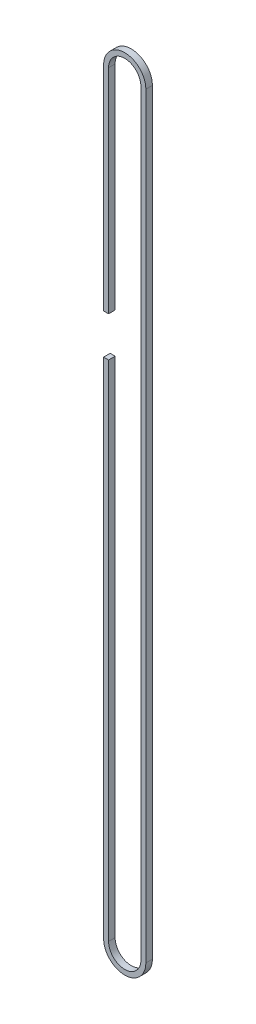
ISO-10303-21;
HEADER;
FILE_DESCRIPTION(('STEP AP214'),'2;1');
FILE_NAME('part.step','',(''),(''),'','','');
FILE_SCHEMA(('AUTOMOTIVE_DESIGN { 1 0 10303 214 1 1 1 1 }'));
ENDSEC;
DATA;
#1=APPLICATION_CONTEXT('core data for automotive mechanical design processes');
#2=APPLICATION_PROTOCOL_DEFINITION('international standard','automotive_design',2000,#1);
#3=PRODUCT_CONTEXT('',#1,'mechanical');
#4=PRODUCT('Part','Part','',(#3));
#5=PRODUCT_RELATED_PRODUCT_CATEGORY('part','',(#4));
#6=PRODUCT_DEFINITION_FORMATION('','',#4);
#7=PRODUCT_DEFINITION_CONTEXT('part definition',#1,'design');
#8=PRODUCT_DEFINITION('design','',#6,#7);
#9=PRODUCT_DEFINITION_SHAPE('','',#8);
#10=(LENGTH_UNIT() NAMED_UNIT(*) SI_UNIT(.MILLI.,.METRE.));
#11=(NAMED_UNIT(*) PLANE_ANGLE_UNIT() SI_UNIT($,.RADIAN.));
#12=(NAMED_UNIT(*) SI_UNIT($,.STERADIAN.) SOLID_ANGLE_UNIT());
#13=UNCERTAINTY_MEASURE_WITH_UNIT(LENGTH_MEASURE(1.E-05),#10,'distance_accuracy_value','');
#14=(GEOMETRIC_REPRESENTATION_CONTEXT(3) GLOBAL_UNCERTAINTY_ASSIGNED_CONTEXT((#13)) GLOBAL_UNIT_ASSIGNED_CONTEXT((#10,
#11,#12)) REPRESENTATION_CONTEXT('',''));
#15=CARTESIAN_POINT('',(0.,0.,0.));
#16=DIRECTION('',(0.,0.,1.));
#17=DIRECTION('',(1.,0.,0.));
#18=AXIS2_PLACEMENT_3D('',#15,#16,#17);
#19=CARTESIAN_POINT('',(0.,901.7,3.8989));
#20=DIRECTION('',(0.,0.,-1.));
#21=DIRECTION('',(-1.,0.,0.));
#22=AXIS2_PLACEMENT_3D('',#19,#20,#21);
#23=CYLINDRICAL_SURFACE('',#22,25.1587);
#24=CARTESIAN_POINT('',(0.,901.7,-3.8989));
#25=DIRECTION('',(0.,0.,1.));
#26=DIRECTION('',(-1.,0.,0.));
#27=AXIS2_PLACEMENT_3D('',#24,#25,#26);
#28=CIRCLE('',#27,25.1587);
#29=CARTESIAN_POINT('',(25.1587,901.7,-3.8989));
#30=VERTEX_POINT('',#29);
#31=CARTESIAN_POINT('',(-25.1587,901.7,-3.8989));
#32=VERTEX_POINT('',#31);
#33=EDGE_CURVE('E159',#30,#32,#28,.T.);
#34=ORIENTED_EDGE('',*,*,#33,.T.);
#35=DIRECTION('',(0.,0.,-1.));
#36=VECTOR('',#35,1.);
#37=CARTESIAN_POINT('',(-25.1587,901.7,3.8989));
#38=LINE('',#37,#36);
#39=CARTESIAN_POINT('',(-25.1587,901.7,3.8989));
#40=VERTEX_POINT('',#39);
#41=EDGE_CURVE('E11',#40,#32,#38,.T.);
#42=ORIENTED_EDGE('',*,*,#41,.F.);
#43=CARTESIAN_POINT('',(0.,901.7,3.8989));
#44=DIRECTION('',(0.,0.,1.));
#45=DIRECTION('',(-1.,0.,0.));
#46=AXIS2_PLACEMENT_3D('',#43,#44,#45);
#47=CIRCLE('',#46,25.1587);
#48=CARTESIAN_POINT('',(25.1587,901.7,3.8989));
#49=VERTEX_POINT('',#48);
#50=EDGE_CURVE('E181',#49,#40,#47,.T.);
#51=ORIENTED_EDGE('',*,*,#50,.F.);
#52=DIRECTION('',(0.,0.,-1.));
#53=VECTOR('',#52,1.);
#54=CARTESIAN_POINT('',(25.1587,901.7,3.8989));
#55=LINE('',#54,#53);
#56=EDGE_CURVE('E155',#49,#30,#55,.T.);
#57=ORIENTED_EDGE('',*,*,#56,.T.);
#58=EDGE_LOOP('',(#34,#42,#51,#57));
#59=FACE_BOUND('',#58,.T.);
#60=ADVANCED_FACE('F39',(#59),#23,.T.);
#61=CARTESIAN_POINT('',(-25.1587,901.7,3.8989));
#62=DIRECTION('',(1.,0.,0.));
#63=DIRECTION('',(0.,1.,0.));
#64=AXIS2_PLACEMENT_3D('',#61,#62,#63);
#65=PLANE('',#64);
#66=DIRECTION('',(0.,-1.,0.));
#67=VECTOR('',#66,1.);
#68=CARTESIAN_POINT('',(-25.1587,901.7,-3.8989));
#69=LINE('',#68,#67);
#70=CARTESIAN_POINT('',(-25.1587000000001,647.7,-3.8989));
#71=VERTEX_POINT('',#70);
#72=EDGE_CURVE('E162',#32,#71,#69,.T.);
#73=ORIENTED_EDGE('',*,*,#72,.T.);
#74=DIRECTION('',(0.,0.,-1.));
#75=VECTOR('',#74,1.);
#76=CARTESIAN_POINT('',(-25.1587000000001,647.7,3.8989));
#77=LINE('',#76,#75);
#78=CARTESIAN_POINT('',(-25.1587000000001,647.7,3.8989));
#79=VERTEX_POINT('',#78);
#80=EDGE_CURVE('E47',#79,#71,#77,.T.);
#81=ORIENTED_EDGE('',*,*,#80,.F.);
#82=DIRECTION('',(0.,-1.,0.));
#83=VECTOR('',#82,1.);
#84=CARTESIAN_POINT('',(-25.1587,901.7,3.8989));
#85=LINE('',#84,#83);
#86=EDGE_CURVE('E110',#40,#79,#85,.T.);
#87=ORIENTED_EDGE('',*,*,#86,.F.);
#88=ORIENTED_EDGE('',*,*,#41,.T.);
#89=EDGE_LOOP('',(#73,#81,#87,#88));
#90=FACE_BOUND('',#89,.T.);
#91=ADVANCED_FACE('F259',(#90),#65,.F.);
#92=CARTESIAN_POINT('',(-25.1587000000001,647.7,3.8989));
#93=DIRECTION('',(0.,1.,0.));
#94=DIRECTION('',(0.,0.,1.));
#95=AXIS2_PLACEMENT_3D('',#92,#93,#94);
#96=PLANE('',#95);
#97=DIRECTION('',(1.,0.,0.));
#98=VECTOR('',#97,1.);
#99=CARTESIAN_POINT('',(-25.1587000000001,647.7,-3.8989));
#100=LINE('',#99,#98);
#101=CARTESIAN_POINT('',(-19.2659000000001,647.7,-3.8989));
#102=VERTEX_POINT('',#101);
#103=EDGE_CURVE('E164',#71,#102,#100,.T.);
#104=ORIENTED_EDGE('',*,*,#103,.T.);
#105=DIRECTION('',(0.,0.,-1.));
#106=VECTOR('',#105,1.);
#107=CARTESIAN_POINT('',(-19.2659000000001,647.7,3.8989));
#108=LINE('',#107,#106);
#109=CARTESIAN_POINT('',(-19.2659000000001,647.7,3.8989));
#110=VERTEX_POINT('',#109);
#111=EDGE_CURVE('E200',#110,#102,#108,.T.);
#112=ORIENTED_EDGE('',*,*,#111,.F.);
#113=DIRECTION('',(1.,0.,0.));
#114=VECTOR('',#113,1.);
#115=CARTESIAN_POINT('',(-25.1587000000001,647.7,3.8989));
#116=LINE('',#115,#114);
#117=EDGE_CURVE('E208',#79,#110,#116,.T.);
#118=ORIENTED_EDGE('',*,*,#117,.F.);
#119=ORIENTED_EDGE('',*,*,#80,.T.);
#120=EDGE_LOOP('',(#104,#112,#118,#119));
#121=FACE_BOUND('',#120,.T.);
#122=ADVANCED_FACE('F206',(#121),#96,.F.);
#123=CARTESIAN_POINT('',(-19.2659,901.7,3.8989));
#124=DIRECTION('',(-1.,0.,0.));
#125=DIRECTION('',(0.,-1.,0.));
#126=AXIS2_PLACEMENT_3D('',#123,#124,#125);
#127=PLANE('',#126);
#128=DIRECTION('',(0.,1.,0.));
#129=VECTOR('',#128,1.);
#130=CARTESIAN_POINT('',(-19.2659,901.7,-3.8989));
#131=LINE('',#130,#129);
#132=CARTESIAN_POINT('',(-19.2659,901.7,-3.8989));
#133=VERTEX_POINT('',#132);
#134=EDGE_CURVE('E166',#102,#133,#131,.T.);
#135=ORIENTED_EDGE('',*,*,#134,.T.);
#136=DIRECTION('',(0.,0.,-1.));
#137=VECTOR('',#136,1.);
#138=CARTESIAN_POINT('',(-19.2659,901.7,3.8989));
#139=LINE('',#138,#137);
#140=CARTESIAN_POINT('',(-19.2659,901.7,3.8989));
#141=VERTEX_POINT('',#140);
#142=EDGE_CURVE('E197',#141,#133,#139,.T.);
#143=ORIENTED_EDGE('',*,*,#142,.F.);
#144=DIRECTION('',(0.,1.,0.));
#145=VECTOR('',#144,1.);
#146=CARTESIAN_POINT('',(-19.2659,901.7,3.8989));
#147=LINE('',#146,#145);
#148=EDGE_CURVE('E226',#110,#141,#147,.T.);
#149=ORIENTED_EDGE('',*,*,#148,.F.);
#150=ORIENTED_EDGE('',*,*,#111,.T.);
#151=EDGE_LOOP('',(#135,#143,#149,#150));
#152=FACE_BOUND('',#151,.T.);
#153=ADVANCED_FACE('F217',(#152),#127,.F.);
#154=CARTESIAN_POINT('',(0.,901.7,3.8989));
#155=DIRECTION('',(0.,0.,-1.));
#156=DIRECTION('',(-1.,0.,0.));
#157=AXIS2_PLACEMENT_3D('',#154,#155,#156);
#158=CYLINDRICAL_SURFACE('',#157,19.2659000000001);
#159=CARTESIAN_POINT('',(0.,901.7,-3.8989));
#160=DIRECTION('',(0.,0.,-1.));
#161=DIRECTION('',(-1.,0.,0.));
#162=AXIS2_PLACEMENT_3D('',#159,#160,#161);
#163=CIRCLE('',#162,19.2659000000001);
#164=CARTESIAN_POINT('',(19.2659000000001,901.7,-3.8989));
#165=VERTEX_POINT('',#164);
#166=EDGE_CURVE('E168',#133,#165,#163,.T.);
#167=ORIENTED_EDGE('',*,*,#166,.T.);
#168=DIRECTION('',(0.,0.,-1.));
#169=VECTOR('',#168,1.);
#170=CARTESIAN_POINT('',(19.2659000000001,901.7,3.8989));
#171=LINE('',#170,#169);
#172=CARTESIAN_POINT('',(19.2659000000001,901.7,3.8989));
#173=VERTEX_POINT('',#172);
#174=EDGE_CURVE('E194',#173,#165,#171,.T.);
#175=ORIENTED_EDGE('',*,*,#174,.F.);
#176=CARTESIAN_POINT('',(0.,901.7,3.8989));
#177=DIRECTION('',(0.,0.,-1.));
#178=DIRECTION('',(-1.,0.,0.));
#179=AXIS2_PLACEMENT_3D('',#176,#177,#178);
#180=CIRCLE('',#179,19.2659000000001);
#181=EDGE_CURVE('E223',#141,#173,#180,.T.);
#182=ORIENTED_EDGE('',*,*,#181,.F.);
#183=ORIENTED_EDGE('',*,*,#142,.T.);
#184=EDGE_LOOP('',(#167,#175,#182,#183));
#185=FACE_BOUND('',#184,.T.);
#186=ADVANCED_FACE('F221',(#185),#158,.F.);
#187=CARTESIAN_POINT('',(19.2659000000001,0.,3.8989));
#188=DIRECTION('',(1.,0.,0.));
#189=DIRECTION('',(0.,0.,-1.));
#190=AXIS2_PLACEMENT_3D('',#187,#188,#189);
#191=PLANE('',#190);
#192=DIRECTION('',(0.,-1.,0.));
#193=VECTOR('',#192,1.);
#194=CARTESIAN_POINT('',(19.2659000000001,0.,-3.8989));
#195=LINE('',#194,#193);
#196=CARTESIAN_POINT('',(19.2659000000001,0.,-3.8989));
#197=VERTEX_POINT('',#196);
#198=EDGE_CURVE('E170',#165,#197,#195,.T.);
#199=ORIENTED_EDGE('',*,*,#198,.T.);
#200=DIRECTION('',(0.,0.,-1.));
#201=VECTOR('',#200,1.);
#202=CARTESIAN_POINT('',(19.2659000000001,0.,3.8989));
#203=LINE('',#202,#201);
#204=CARTESIAN_POINT('',(19.2659000000001,0.,3.8989));
#205=VERTEX_POINT('',#204);
#206=EDGE_CURVE('E191',#205,#197,#203,.T.);
#207=ORIENTED_EDGE('',*,*,#206,.F.);
#208=DIRECTION('',(0.,-1.,0.));
#209=VECTOR('',#208,1.);
#210=CARTESIAN_POINT('',(19.2659000000001,0.,3.8989));
#211=LINE('',#210,#209);
#212=EDGE_CURVE('E225',#173,#205,#211,.T.);
#213=ORIENTED_EDGE('',*,*,#212,.F.);
#214=ORIENTED_EDGE('',*,*,#174,.T.);
#215=EDGE_LOOP('',(#199,#207,#213,#214));
#216=FACE_BOUND('',#215,.T.);
#217=ADVANCED_FACE('F272',(#216),#191,.F.);
#218=CARTESIAN_POINT('',(0.,0.,3.8989));
#219=DIRECTION('',(0.,0.,-1.));
#220=DIRECTION('',(-1.,0.,0.));
#221=AXIS2_PLACEMENT_3D('',#218,#219,#220);
#222=CYLINDRICAL_SURFACE('',#221,19.2659000000001);
#223=CARTESIAN_POINT('',(0.,0.,-3.8989));
#224=DIRECTION('',(0.,0.,-1.));
#225=DIRECTION('',(1.,0.,0.));
#226=AXIS2_PLACEMENT_3D('',#223,#224,#225);
#227=CIRCLE('',#226,19.2659000000001);
#228=CARTESIAN_POINT('',(-19.2659000000001,0.,-3.8989));
#229=VERTEX_POINT('',#228);
#230=EDGE_CURVE('E172',#197,#229,#227,.T.);
#231=ORIENTED_EDGE('',*,*,#230,.T.);
#232=DIRECTION('',(0.,0.,-1.));
#233=VECTOR('',#232,1.);
#234=CARTESIAN_POINT('',(-19.2659000000001,0.,3.8989));
#235=LINE('',#234,#233);
#236=CARTESIAN_POINT('',(-19.2659000000001,0.,3.8989));
#237=VERTEX_POINT('',#236);
#238=EDGE_CURVE('E188',#237,#229,#235,.T.);
#239=ORIENTED_EDGE('',*,*,#238,.F.);
#240=CARTESIAN_POINT('',(0.,0.,3.8989));
#241=DIRECTION('',(0.,0.,-1.));
#242=DIRECTION('',(1.,0.,0.));
#243=AXIS2_PLACEMENT_3D('',#240,#241,#242);
#244=CIRCLE('',#243,19.2659000000001);
#245=EDGE_CURVE('E228',#205,#237,#244,.T.);
#246=ORIENTED_EDGE('',*,*,#245,.F.);
#247=ORIENTED_EDGE('',*,*,#206,.T.);
#248=EDGE_LOOP('',(#231,#239,#246,#247));
#249=FACE_BOUND('',#248,.T.);
#250=ADVANCED_FACE('F275',(#249),#222,.F.);
#251=CARTESIAN_POINT('',(-19.2659000000001,600.075,3.8989));
#252=DIRECTION('',(-1.,0.,0.));
#253=DIRECTION('',(0.,-1.,0.));
#254=AXIS2_PLACEMENT_3D('',#251,#252,#253);
#255=PLANE('',#254);
#256=DIRECTION('',(0.,1.,0.));
#257=VECTOR('',#256,1.);
#258=CARTESIAN_POINT('',(-19.2659000000001,600.075,-3.8989));
#259=LINE('',#258,#257);
#260=CARTESIAN_POINT('',(-19.2659000000001,600.075,-3.8989));
#261=VERTEX_POINT('',#260);
#262=EDGE_CURVE('E174',#229,#261,#259,.T.);
#263=ORIENTED_EDGE('',*,*,#262,.T.);
#264=DIRECTION('',(0.,0.,-1.));
#265=VECTOR('',#264,1.);
#266=CARTESIAN_POINT('',(-19.2659000000001,600.075,3.8989));
#267=LINE('',#266,#265);
#268=CARTESIAN_POINT('',(-19.2659000000001,600.075,3.8989));
#269=VERTEX_POINT('',#268);
#270=EDGE_CURVE('E185',#269,#261,#267,.T.);
#271=ORIENTED_EDGE('',*,*,#270,.F.);
#272=DIRECTION('',(0.,1.,0.));
#273=VECTOR('',#272,1.);
#274=CARTESIAN_POINT('',(-19.2659000000001,600.075,3.8989));
#275=LINE('',#274,#273);
#276=EDGE_CURVE('E234',#237,#269,#275,.T.);
#277=ORIENTED_EDGE('',*,*,#276,.F.);
#278=ORIENTED_EDGE('',*,*,#238,.T.);
#279=EDGE_LOOP('',(#263,#271,#277,#278));
#280=FACE_BOUND('',#279,.T.);
#281=ADVANCED_FACE('F240',(#280),#255,.F.);
#282=CARTESIAN_POINT('',(-19.2659000000001,600.075,3.8989));
#283=DIRECTION('',(0.,-1.,0.));
#284=DIRECTION('',(0.,0.,-1.));
#285=AXIS2_PLACEMENT_3D('',#282,#283,#284);
#286=PLANE('',#285);
#287=DIRECTION('',(-1.,0.,0.));
#288=VECTOR('',#287,1.);
#289=CARTESIAN_POINT('',(-19.2659000000001,600.075,-3.8989));
#290=LINE('',#289,#288);
#291=CARTESIAN_POINT('',(-25.1587000000001,600.075,-3.8989));
#292=VERTEX_POINT('',#291);
#293=EDGE_CURVE('E176',#261,#292,#290,.T.);
#294=ORIENTED_EDGE('',*,*,#293,.T.);
#295=DIRECTION('',(0.,0.,-1.));
#296=VECTOR('',#295,1.);
#297=CARTESIAN_POINT('',(-25.1587000000001,600.075,3.8989));
#298=LINE('',#297,#296);
#299=CARTESIAN_POINT('',(-25.1587000000001,600.075,3.8989));
#300=VERTEX_POINT('',#299);
#301=EDGE_CURVE('E150',#300,#292,#298,.T.);
#302=ORIENTED_EDGE('',*,*,#301,.F.);
#303=DIRECTION('',(-1.,0.,0.));
#304=VECTOR('',#303,1.);
#305=CARTESIAN_POINT('',(-19.2659000000001,600.075,3.8989));
#306=LINE('',#305,#304);
#307=EDGE_CURVE('E141',#269,#300,#306,.T.);
#308=ORIENTED_EDGE('',*,*,#307,.F.);
#309=ORIENTED_EDGE('',*,*,#270,.T.);
#310=EDGE_LOOP('',(#294,#302,#308,#309));
#311=FACE_BOUND('',#310,.T.);
#312=ADVANCED_FACE('F244',(#311),#286,.F.);
#313=CARTESIAN_POINT('',(-25.1587000000001,600.075,3.8989));
#314=DIRECTION('',(1.,0.,0.));
#315=DIRECTION('',(0.,1.,0.));
#316=AXIS2_PLACEMENT_3D('',#313,#314,#315);
#317=PLANE('',#316);
#318=DIRECTION('',(0.,-1.,0.));
#319=VECTOR('',#318,1.);
#320=CARTESIAN_POINT('',(-25.1587000000001,600.075,-3.8989));
#321=LINE('',#320,#319);
#322=CARTESIAN_POINT('',(-25.1587,0.,-3.8989));
#323=VERTEX_POINT('',#322);
#324=EDGE_CURVE('E149',#292,#323,#321,.T.);
#325=ORIENTED_EDGE('',*,*,#324,.T.);
#326=DIRECTION('',(0.,0.,-1.));
#327=VECTOR('',#326,1.);
#328=CARTESIAN_POINT('',(-25.1587,0.,3.8989));
#329=LINE('',#328,#327);
#330=CARTESIAN_POINT('',(-25.1587,0.,3.8989));
#331=VERTEX_POINT('',#330);
#332=EDGE_CURVE('E146',#331,#323,#329,.T.);
#333=ORIENTED_EDGE('',*,*,#332,.F.);
#334=DIRECTION('',(0.,-1.,0.));
#335=VECTOR('',#334,1.);
#336=CARTESIAN_POINT('',(-25.1587000000001,600.075,3.8989));
#337=LINE('',#336,#335);
#338=EDGE_CURVE('E135',#300,#331,#337,.T.);
#339=ORIENTED_EDGE('',*,*,#338,.F.);
#340=ORIENTED_EDGE('',*,*,#301,.T.);
#341=EDGE_LOOP('',(#325,#333,#339,#340));
#342=FACE_BOUND('',#341,.T.);
#343=ADVANCED_FACE('F147',(#342),#317,.F.);
#344=CARTESIAN_POINT('',(0.,0.,3.8989));
#345=DIRECTION('',(0.,0.,-1.));
#346=DIRECTION('',(-1.,0.,0.));
#347=AXIS2_PLACEMENT_3D('',#344,#345,#346);
#348=CYLINDRICAL_SURFACE('',#347,25.1587);
#349=CARTESIAN_POINT('',(0.,0.,-3.8989));
#350=DIRECTION('',(0.,0.,1.));
#351=DIRECTION('',(1.,0.,0.));
#352=AXIS2_PLACEMENT_3D('',#349,#350,#351);
#353=CIRCLE('',#352,25.1587);
#354=CARTESIAN_POINT('',(25.1587,0.,-3.8989));
#355=VERTEX_POINT('',#354);
#356=EDGE_CURVE('E96',#323,#355,#353,.T.);
#357=ORIENTED_EDGE('',*,*,#356,.T.);
#358=DIRECTION('',(0.,0.,-1.));
#359=VECTOR('',#358,1.);
#360=CARTESIAN_POINT('',(25.1587,0.,3.8989));
#361=LINE('',#360,#359);
#362=CARTESIAN_POINT('',(25.1587,0.,3.8989));
#363=VERTEX_POINT('',#362);
#364=EDGE_CURVE('E151',#363,#355,#361,.T.);
#365=ORIENTED_EDGE('',*,*,#364,.F.);
#366=CARTESIAN_POINT('',(0.,0.,3.8989));
#367=DIRECTION('',(0.,0.,1.));
#368=DIRECTION('',(1.,0.,0.));
#369=AXIS2_PLACEMENT_3D('',#366,#367,#368);
#370=CIRCLE('',#369,25.1587);
#371=EDGE_CURVE('E139',#331,#363,#370,.T.);
#372=ORIENTED_EDGE('',*,*,#371,.F.);
#373=ORIENTED_EDGE('',*,*,#332,.T.);
#374=EDGE_LOOP('',(#357,#365,#372,#373));
#375=FACE_BOUND('',#374,.T.);
#376=ADVANCED_FACE('F153',(#375),#348,.T.);
#377=CARTESIAN_POINT('',(25.1587,0.,3.8989));
#378=DIRECTION('',(-1.,0.,0.));
#379=DIRECTION('',(0.,-1.,0.));
#380=AXIS2_PLACEMENT_3D('',#377,#378,#379);
#381=PLANE('',#380);
#382=DIRECTION('',(0.,1.,0.));
#383=VECTOR('',#382,1.);
#384=CARTESIAN_POINT('',(25.1587,0.,-3.8989));
#385=LINE('',#384,#383);
#386=EDGE_CURVE('E102',#355,#30,#385,.T.);
#387=ORIENTED_EDGE('',*,*,#386,.T.);
#388=ORIENTED_EDGE('',*,*,#56,.F.);
#389=DIRECTION('',(0.,1.,0.));
#390=VECTOR('',#389,1.);
#391=CARTESIAN_POINT('',(25.1587,0.,3.8989));
#392=LINE('',#391,#390);
#393=EDGE_CURVE('E55',#363,#49,#392,.T.);
#394=ORIENTED_EDGE('',*,*,#393,.F.);
#395=ORIENTED_EDGE('',*,*,#364,.T.);
#396=EDGE_LOOP('',(#387,#388,#394,#395));
#397=FACE_BOUND('',#396,.T.);
#398=ADVANCED_FACE('F248',(#397),#381,.F.);
#399=CARTESIAN_POINT('',(0.,901.7,3.8989));
#400=DIRECTION('',(0.,0.,-1.));
#401=DIRECTION('',(-1.,0.,0.));
#402=AXIS2_PLACEMENT_3D('',#399,#400,#401);
#403=PLANE('',#402);
#404=ORIENTED_EDGE('',*,*,#50,.T.);
#405=ORIENTED_EDGE('',*,*,#86,.T.);
#406=ORIENTED_EDGE('',*,*,#117,.T.);
#407=ORIENTED_EDGE('',*,*,#148,.T.);
#408=ORIENTED_EDGE('',*,*,#181,.T.);
#409=ORIENTED_EDGE('',*,*,#212,.T.);
#410=ORIENTED_EDGE('',*,*,#245,.T.);
#411=ORIENTED_EDGE('',*,*,#276,.T.);
#412=ORIENTED_EDGE('',*,*,#307,.T.);
#413=ORIENTED_EDGE('',*,*,#338,.T.);
#414=ORIENTED_EDGE('',*,*,#371,.T.);
#415=ORIENTED_EDGE('',*,*,#393,.T.);
#416=EDGE_LOOP('',(#404,#405,#406,#407,#408,#409,#410,#411,#412,#413,#414,#415));
#417=FACE_BOUND('',#416,.T.);
#418=ADVANCED_FACE('F137',(#417),#403,.F.);
#419=CARTESIAN_POINT('',(0.,901.7,-3.8989));
#420=DIRECTION('',(0.,0.,-1.));
#421=DIRECTION('',(-1.,0.,0.));
#422=AXIS2_PLACEMENT_3D('',#419,#420,#421);
#423=PLANE('',#422);
#424=ORIENTED_EDGE('',*,*,#33,.F.);
#425=ORIENTED_EDGE('',*,*,#386,.F.);
#426=ORIENTED_EDGE('',*,*,#356,.F.);
#427=ORIENTED_EDGE('',*,*,#324,.F.);
#428=ORIENTED_EDGE('',*,*,#293,.F.);
#429=ORIENTED_EDGE('',*,*,#262,.F.);
#430=ORIENTED_EDGE('',*,*,#230,.F.);
#431=ORIENTED_EDGE('',*,*,#198,.F.);
#432=ORIENTED_EDGE('',*,*,#166,.F.);
#433=ORIENTED_EDGE('',*,*,#134,.F.);
#434=ORIENTED_EDGE('',*,*,#103,.F.);
#435=ORIENTED_EDGE('',*,*,#72,.F.);
#436=EDGE_LOOP('',(#424,#425,#426,#427,#428,#429,#430,#431,#432,#433,#434,#435));
#437=FACE_BOUND('',#436,.T.);
#438=ADVANCED_FACE('F212',(#437),#423,.T.);
#439=CLOSED_SHELL('',(#60,#91,#122,#153,#186,#217,#250,#281,#312,#343,#376,#398,#418,#438));
#440=MANIFOLD_SOLID_BREP('B2',#439);
#441=ADVANCED_BREP_SHAPE_REPRESENTATION('',(#18,#440),#14);
#442=SHAPE_DEFINITION_REPRESENTATION(#9,#441);
ENDSEC;
END-ISO-10303-21;
